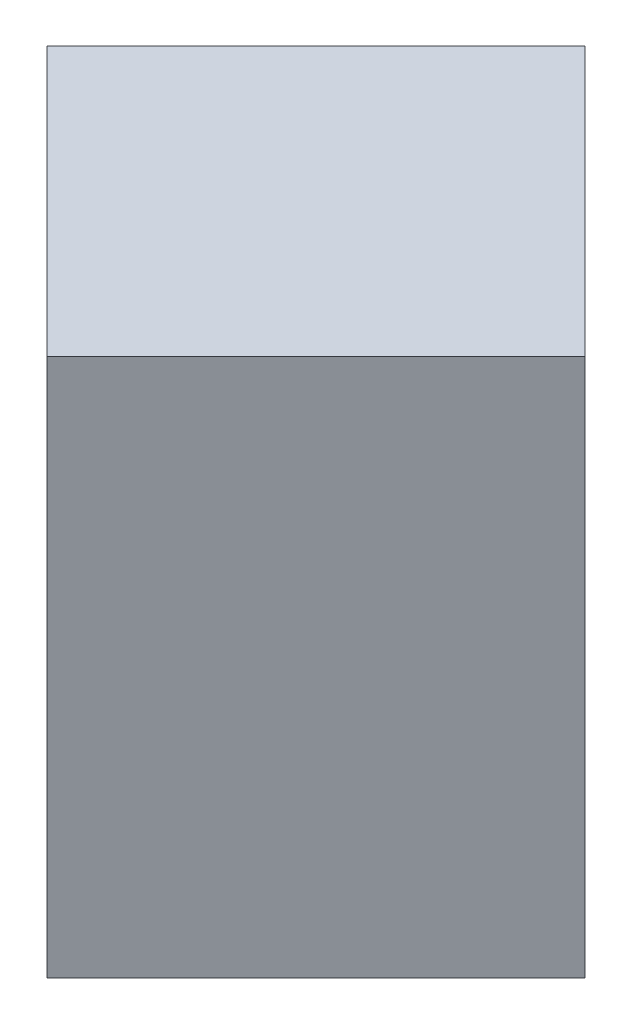
ISO-10303-21;
HEADER;
FILE_DESCRIPTION(('STEP AP214'),'2;1');
FILE_NAME('part.step','',(''),(''),'','','');
FILE_SCHEMA(('AUTOMOTIVE_DESIGN { 1 0 10303 214 1 1 1 1 }'));
ENDSEC;
DATA;
#1=APPLICATION_CONTEXT('core data for automotive mechanical design processes');
#2=APPLICATION_PROTOCOL_DEFINITION('international standard','automotive_design',2000,#1);
#3=PRODUCT_CONTEXT('',#1,'mechanical');
#4=PRODUCT('Part','Part','',(#3));
#5=PRODUCT_RELATED_PRODUCT_CATEGORY('part','',(#4));
#6=PRODUCT_DEFINITION_FORMATION('','',#4);
#7=PRODUCT_DEFINITION_CONTEXT('part definition',#1,'design');
#8=PRODUCT_DEFINITION('design','',#6,#7);
#9=PRODUCT_DEFINITION_SHAPE('','',#8);
#10=(LENGTH_UNIT() NAMED_UNIT(*) SI_UNIT(.MILLI.,.METRE.));
#11=(NAMED_UNIT(*) PLANE_ANGLE_UNIT() SI_UNIT($,.RADIAN.));
#12=(NAMED_UNIT(*) SI_UNIT($,.STERADIAN.) SOLID_ANGLE_UNIT());
#13=UNCERTAINTY_MEASURE_WITH_UNIT(LENGTH_MEASURE(1.E-05),#10,'distance_accuracy_value','');
#14=(GEOMETRIC_REPRESENTATION_CONTEXT(3) GLOBAL_UNCERTAINTY_ASSIGNED_CONTEXT((#13)) GLOBAL_UNIT_ASSIGNED_CONTEXT((#10,
#11,#12)) REPRESENTATION_CONTEXT('',''));
#15=CARTESIAN_POINT('',(0.,0.,0.));
#16=DIRECTION('',(0.,0.,1.));
#17=DIRECTION('',(1.,0.,0.));
#18=AXIS2_PLACEMENT_3D('',#15,#16,#17);
#19=CARTESIAN_POINT('',(0.,0.,20.));
#20=DIRECTION('',(0.,1.,0.));
#21=DIRECTION('',(0.,0.,1.));
#22=AXIS2_PLACEMENT_3D('',#19,#20,#21);
#23=PLANE('',#22);
#24=DIRECTION('',(-0.707106781186548,0.,0.707106781186548));
#25=VECTOR('',#24,1.);
#26=CARTESIAN_POINT('',(20.,0.,10.));
#27=LINE('',#26,#25);
#28=CARTESIAN_POINT('',(20.,0.,10.));
#29=VERTEX_POINT('',#28);
#30=CARTESIAN_POINT('',(10.,0.,20.));
#31=VERTEX_POINT('',#30);
#32=EDGE_CURVE('E46',#29,#31,#27,.T.);
#33=ORIENTED_EDGE('',*,*,#32,.T.);
#34=DIRECTION('',(-0.707106781186548,0.,-0.707106781186548));
#35=VECTOR('',#34,1.);
#36=CARTESIAN_POINT('',(0.,0.,10.));
#37=LINE('',#36,#35);
#38=CARTESIAN_POINT('',(0.,0.,10.));
#39=VERTEX_POINT('',#38);
#40=EDGE_CURVE('E68',#31,#39,#37,.T.);
#41=ORIENTED_EDGE('',*,*,#40,.T.);
#42=DIRECTION('',(0.707106781186548,0.,-0.707106781186548));
#43=VECTOR('',#42,1.);
#44=CARTESIAN_POINT('',(10.,0.,0.));
#45=LINE('',#44,#43);
#46=CARTESIAN_POINT('',(10.,0.,0.));
#47=VERTEX_POINT('',#46);
#48=EDGE_CURVE('E105',#39,#47,#45,.T.);
#49=ORIENTED_EDGE('',*,*,#48,.T.);
#50=DIRECTION('',(0.707106781186548,0.,0.707106781186548));
#51=VECTOR('',#50,1.);
#52=CARTESIAN_POINT('',(10.,0.,0.));
#53=LINE('',#52,#51);
#54=EDGE_CURVE('E88',#47,#29,#53,.T.);
#55=ORIENTED_EDGE('',*,*,#54,.T.);
#56=EDGE_LOOP('',(#33,#41,#49,#55));
#57=FACE_BOUND('',#56,.T.);
#58=ADVANCED_FACE('F33',(#57),#23,.F.);
#59=CARTESIAN_POINT('',(0.,20.,20.));
#60=DIRECTION('',(0.,-1.,0.));
#61=DIRECTION('',(0.,0.,-1.));
#62=AXIS2_PLACEMENT_3D('',#59,#60,#61);
#63=PLANE('',#62);
#64=DIRECTION('',(0.707106781186548,0.,-0.707106781186548));
#65=VECTOR('',#64,1.);
#66=CARTESIAN_POINT('',(10.,20.,0.));
#67=LINE('',#66,#65);
#68=CARTESIAN_POINT('',(0.,20.,10.));
#69=VERTEX_POINT('',#68);
#70=CARTESIAN_POINT('',(10.,20.,0.));
#71=VERTEX_POINT('',#70);
#72=EDGE_CURVE('E77',#69,#71,#67,.T.);
#73=ORIENTED_EDGE('',*,*,#72,.F.);
#74=DIRECTION('',(-0.707106781186548,0.,-0.707106781186548));
#75=VECTOR('',#74,1.);
#76=CARTESIAN_POINT('',(0.,20.,10.));
#77=LINE('',#76,#75);
#78=CARTESIAN_POINT('',(10.,20.,20.));
#79=VERTEX_POINT('',#78);
#80=EDGE_CURVE('E78',#79,#69,#77,.T.);
#81=ORIENTED_EDGE('',*,*,#80,.F.);
#82=DIRECTION('',(-0.707106781186548,0.,0.707106781186548));
#83=VECTOR('',#82,1.);
#84=CARTESIAN_POINT('',(20.,20.,10.));
#85=LINE('',#84,#83);
#86=CARTESIAN_POINT('',(20.,20.,10.));
#87=VERTEX_POINT('',#86);
#88=EDGE_CURVE('E83',#87,#79,#85,.T.);
#89=ORIENTED_EDGE('',*,*,#88,.F.);
#90=DIRECTION('',(0.707106781186548,0.,0.707106781186548));
#91=VECTOR('',#90,1.);
#92=CARTESIAN_POINT('',(10.,20.,0.));
#93=LINE('',#92,#91);
#94=EDGE_CURVE('E84',#71,#87,#93,.T.);
#95=ORIENTED_EDGE('',*,*,#94,.F.);
#96=EDGE_LOOP('',(#73,#81,#89,#95));
#97=FACE_BOUND('',#96,.T.);
#98=ADVANCED_FACE('F102',(#97),#63,.F.);
#99=CARTESIAN_POINT('',(10.,0.,0.));
#100=DIRECTION('',(-0.707106781186548,0.,0.707106781186548));
#101=DIRECTION('',(0.707106781186548,0.,0.707106781186548));
#102=AXIS2_PLACEMENT_3D('',#99,#100,#101);
#103=PLANE('',#102);
#104=ORIENTED_EDGE('',*,*,#94,.T.);
#105=DIRECTION('',(0.,1.,0.));
#106=VECTOR('',#105,1.);
#107=CARTESIAN_POINT('',(20.,0.,10.));
#108=LINE('',#107,#106);
#109=EDGE_CURVE('E11',#29,#87,#108,.T.);
#110=ORIENTED_EDGE('',*,*,#109,.F.);
#111=ORIENTED_EDGE('',*,*,#54,.F.);
#112=DIRECTION('',(0.,1.,0.));
#113=VECTOR('',#112,1.);
#114=CARTESIAN_POINT('',(10.,0.,0.));
#115=LINE('',#114,#113);
#116=EDGE_CURVE('E36',#47,#71,#115,.T.);
#117=ORIENTED_EDGE('',*,*,#116,.T.);
#118=EDGE_LOOP('',(#104,#110,#111,#117));
#119=FACE_BOUND('',#118,.T.);
#120=ADVANCED_FACE('F99',(#119),#103,.F.);
#121=CARTESIAN_POINT('',(20.,0.,10.));
#122=DIRECTION('',(-0.707106781186548,0.,-0.707106781186548));
#123=DIRECTION('',(-0.707106781186548,0.,0.707106781186548));
#124=AXIS2_PLACEMENT_3D('',#121,#122,#123);
#125=PLANE('',#124);
#126=ORIENTED_EDGE('',*,*,#88,.T.);
#127=DIRECTION('',(0.,1.,0.));
#128=VECTOR('',#127,1.);
#129=CARTESIAN_POINT('',(10.,0.,20.));
#130=LINE('',#129,#128);
#131=EDGE_CURVE('E70',#31,#79,#130,.T.);
#132=ORIENTED_EDGE('',*,*,#131,.F.);
#133=ORIENTED_EDGE('',*,*,#32,.F.);
#134=ORIENTED_EDGE('',*,*,#109,.T.);
#135=EDGE_LOOP('',(#126,#132,#133,#134));
#136=FACE_BOUND('',#135,.T.);
#137=ADVANCED_FACE('F81',(#136),#125,.F.);
#138=CARTESIAN_POINT('',(10.,0.,0.));
#139=DIRECTION('',(0.707106781186548,0.,0.707106781186548));
#140=DIRECTION('',(0.707106781186548,0.,-0.707106781186548));
#141=AXIS2_PLACEMENT_3D('',#138,#139,#140);
#142=PLANE('',#141);
#143=ORIENTED_EDGE('',*,*,#72,.T.);
#144=ORIENTED_EDGE('',*,*,#116,.F.);
#145=ORIENTED_EDGE('',*,*,#48,.F.);
#146=DIRECTION('',(0.,1.,0.));
#147=VECTOR('',#146,1.);
#148=CARTESIAN_POINT('',(0.,0.,10.));
#149=LINE('',#148,#147);
#150=EDGE_CURVE('E73',#39,#69,#149,.T.);
#151=ORIENTED_EDGE('',*,*,#150,.T.);
#152=EDGE_LOOP('',(#143,#144,#145,#151));
#153=FACE_BOUND('',#152,.T.);
#154=ADVANCED_FACE('F107',(#153),#142,.F.);
#155=CARTESIAN_POINT('',(0.,0.,10.));
#156=DIRECTION('',(0.707106781186548,0.,-0.707106781186548));
#157=DIRECTION('',(-0.707106781186548,0.,-0.707106781186548));
#158=AXIS2_PLACEMENT_3D('',#155,#156,#157);
#159=PLANE('',#158);
#160=ORIENTED_EDGE('',*,*,#80,.T.);
#161=ORIENTED_EDGE('',*,*,#150,.F.);
#162=ORIENTED_EDGE('',*,*,#40,.F.);
#163=ORIENTED_EDGE('',*,*,#131,.T.);
#164=EDGE_LOOP('',(#160,#161,#162,#163));
#165=FACE_BOUND('',#164,.T.);
#166=ADVANCED_FACE('F69',(#165),#159,.F.);
#167=CLOSED_SHELL('',(#58,#98,#120,#137,#154,#166));
#168=MANIFOLD_SOLID_BREP('B2',#167);
#169=ADVANCED_BREP_SHAPE_REPRESENTATION('',(#18,#168),#14);
#170=SHAPE_DEFINITION_REPRESENTATION(#9,#169);
ENDSEC;
END-ISO-10303-21;
